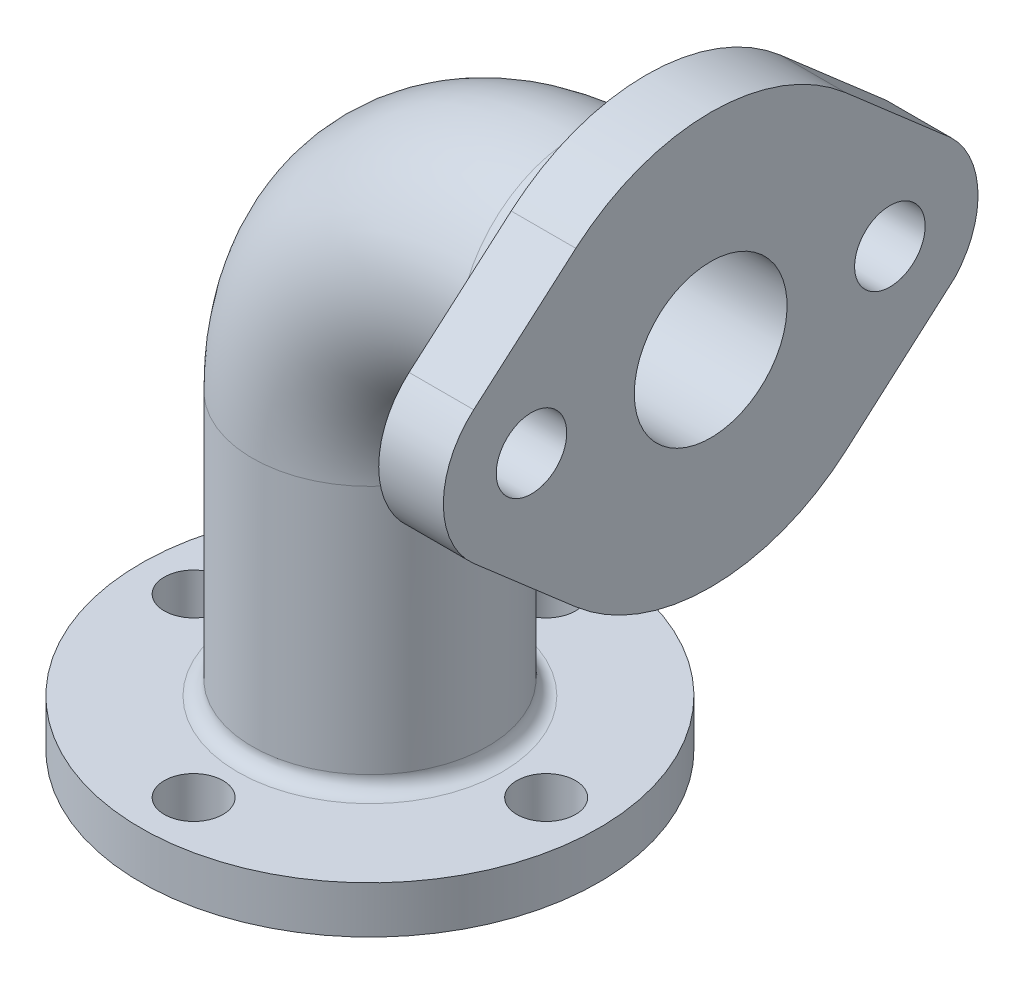
ISO-10303-21;
HEADER;
FILE_DESCRIPTION(('STEP AP214'),'2;1');
FILE_NAME('part.step','',(''),(''),'','','');
FILE_SCHEMA(('AUTOMOTIVE_DESIGN { 1 0 10303 214 1 1 1 1 }'));
ENDSEC;
DATA;
#1=APPLICATION_CONTEXT('core data for automotive mechanical design processes');
#2=APPLICATION_PROTOCOL_DEFINITION('international standard','automotive_design',2000,#1);
#3=PRODUCT_CONTEXT('',#1,'mechanical');
#4=PRODUCT('Part','Part','',(#3));
#5=PRODUCT_RELATED_PRODUCT_CATEGORY('part','',(#4));
#6=PRODUCT_DEFINITION_FORMATION('','',#4);
#7=PRODUCT_DEFINITION_CONTEXT('part definition',#1,'design');
#8=PRODUCT_DEFINITION('design','',#6,#7);
#9=PRODUCT_DEFINITION_SHAPE('','',#8);
#10=(LENGTH_UNIT() NAMED_UNIT(*) SI_UNIT(.MILLI.,.METRE.));
#11=(NAMED_UNIT(*) PLANE_ANGLE_UNIT() SI_UNIT($,.RADIAN.));
#12=(NAMED_UNIT(*) SI_UNIT($,.STERADIAN.) SOLID_ANGLE_UNIT());
#13=UNCERTAINTY_MEASURE_WITH_UNIT(LENGTH_MEASURE(1.E-05),#10,'distance_accuracy_value','');
#14=(GEOMETRIC_REPRESENTATION_CONTEXT(3) GLOBAL_UNCERTAINTY_ASSIGNED_CONTEXT((#13)) GLOBAL_UNIT_ASSIGNED_CONTEXT((#10,
#11,#12)) REPRESENTATION_CONTEXT('',''));
#15=CARTESIAN_POINT('',(0.,0.,0.));
#16=DIRECTION('',(0.,0.,1.));
#17=DIRECTION('',(1.,0.,0.));
#18=AXIS2_PLACEMENT_3D('',#15,#16,#17);
#19=CARTESIAN_POINT('',(0.,0.,0.));
#20=DIRECTION('',(0.,1.,0.));
#21=DIRECTION('',(0.,0.,1.));
#22=AXIS2_PLACEMENT_3D('',#19,#20,#21);
#23=CYLINDRICAL_SURFACE('',#22,20.);
#24=CARTESIAN_POINT('',(0.,10.5,0.));
#25=DIRECTION('',(0.,-1.,0.));
#26=DIRECTION('',(0.,0.,-1.));
#27=AXIS2_PLACEMENT_3D('',#24,#25,#26);
#28=CIRCLE('',#27,20.);
#29=CARTESIAN_POINT('',(0.,10.5,-20.));
#30=VERTEX_POINT('',#29);
#31=EDGE_CURVE('E12',#30,#30,#28,.F.);
#32=ORIENTED_EDGE('',*,*,#31,.T.);
#33=EDGE_LOOP('',(#32));
#34=FACE_BOUND('',#33,.T.);
#35=CARTESIAN_POINT('',(0.,53.,0.));
#36=DIRECTION('',(0.,-1.,0.));
#37=DIRECTION('',(0.,0.,1.));
#38=AXIS2_PLACEMENT_3D('',#35,#36,#37);
#39=CIRCLE('',#38,20.);
#40=CARTESIAN_POINT('',(-20.,53.,0.));
#41=VERTEX_POINT('',#40);
#42=EDGE_CURVE('E227',#41,#41,#39,.T.);
#43=ORIENTED_EDGE('',*,*,#42,.T.);
#44=EDGE_LOOP('',(#43));
#45=FACE_BOUND('',#44,.T.);
#46=ADVANCED_FACE('F57',(#34,#45),#23,.T.);
#47=CARTESIAN_POINT('',(35.,88.,0.));
#48=DIRECTION('',(1.,0.,0.));
#49=DIRECTION('',(0.,0.,-1.));
#50=AXIS2_PLACEMENT_3D('',#47,#48,#49);
#51=CYLINDRICAL_SURFACE('',#50,20.);
#52=CARTESIAN_POINT('',(44.5,88.,0.));
#53=DIRECTION('',(1.,0.,0.));
#54=DIRECTION('',(0.,0.,-1.));
#55=AXIS2_PLACEMENT_3D('',#52,#53,#54);
#56=CIRCLE('',#55,20.);
#57=CARTESIAN_POINT('',(44.5,88.,-20.));
#58=VERTEX_POINT('',#57);
#59=EDGE_CURVE('E257',#58,#58,#56,.F.);
#60=ORIENTED_EDGE('',*,*,#59,.T.);
#61=EDGE_LOOP('',(#60));
#62=FACE_BOUND('',#61,.T.);
#63=CARTESIAN_POINT('',(35.,88.,0.));
#64=DIRECTION('',(-1.,0.,0.));
#65=DIRECTION('',(0.,0.,1.));
#66=AXIS2_PLACEMENT_3D('',#63,#64,#65);
#67=CIRCLE('',#66,20.);
#68=CARTESIAN_POINT('',(35.,108.,0.));
#69=VERTEX_POINT('',#68);
#70=EDGE_CURVE('E231',#69,#69,#67,.T.);
#71=ORIENTED_EDGE('',*,*,#70,.F.);
#72=EDGE_LOOP('',(#71));
#73=FACE_BOUND('',#72,.T.);
#74=ADVANCED_FACE('F278',(#62,#73),#51,.T.);
#75=CARTESIAN_POINT('',(0.,0.,0.));
#76=DIRECTION('',(0.,-1.,0.));
#77=DIRECTION('',(0.,0.,1.));
#78=AXIS2_PLACEMENT_3D('',#75,#76,#77);
#79=PLANE('',#78);
#80=CARTESIAN_POINT('',(0.,0.,30.));
#81=DIRECTION('',(0.,-1.,0.));
#82=DIRECTION('',(0.,0.,-1.));
#83=AXIS2_PLACEMENT_3D('',#80,#81,#82);
#84=CIRCLE('',#83,5.);
#85=CARTESIAN_POINT('',(0.,0.,25.));
#86=VERTEX_POINT('',#85);
#87=EDGE_CURVE('E241',#86,#86,#84,.T.);
#88=ORIENTED_EDGE('',*,*,#87,.F.);
#89=EDGE_LOOP('',(#88));
#90=FACE_BOUND('',#89,.T.);
#91=CARTESIAN_POINT('',(0.,0.,-30.));
#92=DIRECTION('',(0.,-1.,0.));
#93=DIRECTION('',(0.,0.,-1.));
#94=AXIS2_PLACEMENT_3D('',#91,#92,#93);
#95=CIRCLE('',#94,5.);
#96=CARTESIAN_POINT('',(0.,0.,-35.));
#97=VERTEX_POINT('',#96);
#98=EDGE_CURVE('E452',#97,#97,#95,.T.);
#99=ORIENTED_EDGE('',*,*,#98,.F.);
#100=EDGE_LOOP('',(#99));
#101=FACE_BOUND('',#100,.T.);
#102=CARTESIAN_POINT('',(30.,0.,0.));
#103=DIRECTION('',(0.,-1.,0.));
#104=DIRECTION('',(0.,0.,-1.));
#105=AXIS2_PLACEMENT_3D('',#102,#103,#104);
#106=CIRCLE('',#105,5.);
#107=CARTESIAN_POINT('',(30.,0.,-5.));
#108=VERTEX_POINT('',#107);
#109=EDGE_CURVE('E448',#108,#108,#106,.T.);
#110=ORIENTED_EDGE('',*,*,#109,.F.);
#111=EDGE_LOOP('',(#110));
#112=FACE_BOUND('',#111,.T.);
#113=CARTESIAN_POINT('',(-30.,0.,0.));
#114=DIRECTION('',(0.,-1.,0.));
#115=DIRECTION('',(0.,0.,-1.));
#116=AXIS2_PLACEMENT_3D('',#113,#114,#115);
#117=CIRCLE('',#116,5.);
#118=CARTESIAN_POINT('',(-30.,0.,-5.));
#119=VERTEX_POINT('',#118);
#120=EDGE_CURVE('E407',#119,#119,#117,.T.);
#121=ORIENTED_EDGE('',*,*,#120,.F.);
#122=EDGE_LOOP('',(#121));
#123=FACE_BOUND('',#122,.T.);
#124=CARTESIAN_POINT('',(0.,0.,0.));
#125=DIRECTION('',(0.,-1.,0.));
#126=DIRECTION('',(0.,0.,-1.));
#127=AXIS2_PLACEMENT_3D('',#124,#125,#126);
#128=CIRCLE('',#127,13.);
#129=CARTESIAN_POINT('',(0.,0.,-13.));
#130=VERTEX_POINT('',#129);
#131=EDGE_CURVE('E196',#130,#130,#128,.T.);
#132=ORIENTED_EDGE('',*,*,#131,.F.);
#133=EDGE_LOOP('',(#132));
#134=FACE_BOUND('',#133,.T.);
#135=CARTESIAN_POINT('',(0.,0.,0.));
#136=DIRECTION('',(0.,-1.,0.));
#137=DIRECTION('',(0.,0.,-1.));
#138=AXIS2_PLACEMENT_3D('',#135,#136,#137);
#139=CIRCLE('',#138,39.);
#140=CARTESIAN_POINT('',(0.,0.,-39.));
#141=VERTEX_POINT('',#140);
#142=EDGE_CURVE('E253',#141,#141,#139,.T.);
#143=ORIENTED_EDGE('',*,*,#142,.T.);
#144=EDGE_LOOP('',(#143));
#145=FACE_BOUND('',#144,.T.);
#146=ADVANCED_FACE('F284',(#90,#101,#112,#123,#134,#145),#79,.T.);
#147=CARTESIAN_POINT('',(58.,88.,0.));
#148=DIRECTION('',(-1.,0.,0.));
#149=DIRECTION('',(0.,0.,1.));
#150=AXIS2_PLACEMENT_3D('',#147,#148,#149);
#151=PLANE('',#150);
#152=CARTESIAN_POINT('',(58.,88.,0.));
#153=DIRECTION('',(-1.,0.,0.));
#154=DIRECTION('',(0.,0.,1.));
#155=AXIS2_PLACEMENT_3D('',#152,#153,#154);
#156=CIRCLE('',#155,13.);
#157=CARTESIAN_POINT('',(58.,88.,13.));
#158=VERTEX_POINT('',#157);
#159=EDGE_CURVE('E220',#158,#158,#156,.T.);
#160=ORIENTED_EDGE('',*,*,#159,.T.);
#161=EDGE_LOOP('',(#160));
#162=FACE_BOUND('',#161,.T.);
#163=CARTESIAN_POINT('',(58.,88.,-30.5));
#164=DIRECTION('',(1.,0.,0.));
#165=DIRECTION('',(0.,0.,-1.));
#166=AXIS2_PLACEMENT_3D('',#163,#164,#165);
#167=CIRCLE('',#166,6.);
#168=CARTESIAN_POINT('',(58.,88.,-36.5));
#169=VERTEX_POINT('',#168);
#170=EDGE_CURVE('E397',#169,#169,#167,.T.);
#171=ORIENTED_EDGE('',*,*,#170,.F.);
#172=EDGE_LOOP('',(#171));
#173=FACE_BOUND('',#172,.T.);
#174=CARTESIAN_POINT('',(58.,88.,30.5));
#175=DIRECTION('',(1.,0.,0.));
#176=DIRECTION('',(0.,0.,-1.));
#177=AXIS2_PLACEMENT_3D('',#174,#175,#176);
#178=CIRCLE('',#177,6.00000000000001);
#179=CARTESIAN_POINT('',(58.,88.,24.5));
#180=VERTEX_POINT('',#179);
#181=EDGE_CURVE('E412',#180,#180,#178,.T.);
#182=ORIENTED_EDGE('',*,*,#181,.F.);
#183=EDGE_LOOP('',(#182));
#184=FACE_BOUND('',#183,.T.);
#185=CARTESIAN_POINT('',(58.,88.,30.5));
#186=DIRECTION('',(1.,0.,0.));
#187=DIRECTION('',(0.,0.,-1.));
#188=AXIS2_PLACEMENT_3D('',#185,#186,#187);
#189=CIRCLE('',#188,15.);
#190=CARTESIAN_POINT('',(58.,99.3248317439372,40.3360655737705));
#191=VERTEX_POINT('',#190);
#192=CARTESIAN_POINT('',(58.,76.6751682560628,40.3360655737705));
#193=VERTEX_POINT('',#192);
#194=EDGE_CURVE('E163',#191,#193,#189,.T.);
#195=ORIENTED_EDGE('',*,*,#194,.T.);
#196=DIRECTION('',(0.,-0.655737704918033,-0.754988782929145));
#197=VECTOR('',#196,1.);
#198=CARTESIAN_POINT('',(58.,76.6751682560628,40.3360655737705));
#199=LINE('',#198,#197);
#200=CARTESIAN_POINT('',(58.,61.5753925974799,22.9508196721312));
#201=VERTEX_POINT('',#200);
#202=EDGE_CURVE('E167',#193,#201,#199,.T.);
#203=ORIENTED_EDGE('',*,*,#202,.T.);
#204=CARTESIAN_POINT('',(58.,88.,0.));
#205=DIRECTION('',(1.,0.,0.));
#206=DIRECTION('',(0.,0.,-1.));
#207=AXIS2_PLACEMENT_3D('',#204,#205,#206);
#208=CIRCLE('',#207,35.);
#209=CARTESIAN_POINT('',(58.,61.6645545986941,-23.0530760532047));
#210=VERTEX_POINT('',#209);
#211=EDGE_CURVE('E172',#201,#210,#208,.T.);
#212=ORIENTED_EDGE('',*,*,#211,.T.);
#213=DIRECTION('',(0.,0.658659315805848,-0.752441297180167));
#214=VECTOR('',#213,1.);
#215=CARTESIAN_POINT('',(58.,77.855747200422,-41.5496214929858));
#216=LINE('',#215,#214);
#217=CARTESIAN_POINT('',(58.,77.855747200422,-41.5496214929858));
#218=VERTEX_POINT('',#217);
#219=EDGE_CURVE('E176',#210,#218,#216,.T.);
#220=ORIENTED_EDGE('',*,*,#219,.T.);
#221=CARTESIAN_POINT('',(58.,88.,-30.5));
#222=DIRECTION('',(1.,0.,0.));
#223=DIRECTION('',(0.,0.,-1.));
#224=AXIS2_PLACEMENT_3D('',#221,#222,#223);
#225=CIRCLE('',#224,15.);
#226=CARTESIAN_POINT('',(58.,98.8521609170196,-40.8552210710883));
#227=VERTEX_POINT('',#226);
#228=EDGE_CURVE('E180',#218,#227,#225,.T.);
#229=ORIENTED_EDGE('',*,*,#228,.T.);
#230=DIRECTION('',(0.,0.656260611388749,0.754534300041864));
#231=VECTOR('',#230,1.);
#232=CARTESIAN_POINT('',(58.,98.8521609170196,-40.8552210710883));
#233=LINE('',#232,#231);
#234=CARTESIAN_POINT('',(58.,114.408700501465,-22.9691213986062));
#235=VERTEX_POINT('',#234);
#236=EDGE_CURVE('E184',#227,#235,#233,.T.);
#237=ORIENTED_EDGE('',*,*,#236,.T.);
#238=CARTESIAN_POINT('',(58.,88.,0.));
#239=DIRECTION('',(1.,0.,0.));
#240=DIRECTION('',(0.,0.,-1.));
#241=AXIS2_PLACEMENT_3D('',#238,#239,#240);
#242=CIRCLE('',#241,35.);
#243=CARTESIAN_POINT('',(58.,114.42460740252,22.9508196721311));
#244=VERTEX_POINT('',#243);
#245=EDGE_CURVE('E135',#235,#244,#242,.T.);
#246=ORIENTED_EDGE('',*,*,#245,.T.);
#247=DIRECTION('',(0.,-0.655737704918033,0.754988782929145));
#248=VECTOR('',#247,1.);
#249=CARTESIAN_POINT('',(58.,99.3248317439372,40.3360655737705));
#250=LINE('',#249,#248);
#251=EDGE_CURVE('E189',#244,#191,#250,.T.);
#252=ORIENTED_EDGE('',*,*,#251,.T.);
#253=EDGE_LOOP('',(#195,#203,#212,#220,#229,#237,#246,#252));
#254=FACE_BOUND('',#253,.T.);
#255=ADVANCED_FACE('F295',(#162,#173,#184,#254),#151,.F.);
#256=CARTESIAN_POINT('',(35.,53.,0.));
#257=DIRECTION('',(0.,0.,-1.));
#258=DIRECTION('',(-1.,0.,0.));
#259=AXIS2_PLACEMENT_3D('',#256,#257,#258);
#260=TOROIDAL_SURFACE('',#259,35.,20.);
#261=CARTESIAN_POINT('',(35.,53.,0.));
#262=DIRECTION('',(0.,0.,-1.));
#263=DIRECTION('',(-1.,0.,0.));
#264=AXIS2_PLACEMENT_3D('',#261,#262,#263);
#265=CIRCLE('',#264,55.);
#266=EDGE_CURVE('',#41,#69,#265,.T.);
#267=ORIENTED_EDGE('',*,*,#42,.F.);
#268=ORIENTED_EDGE('',*,*,#70,.T.);
#269=ORIENTED_EDGE('',*,*,#266,.T.);
#270=ORIENTED_EDGE('',*,*,#266,.F.);
#271=EDGE_LOOP('',(#267,#269,#268,#270));
#272=FACE_BOUND('',#271,.T.);
#273=ADVANCED_FACE('F287',(#272),#260,.T.);
#274=CARTESIAN_POINT('',(0.,0.,0.));
#275=DIRECTION('',(0.,1.,0.));
#276=DIRECTION('',(0.,0.,1.));
#277=AXIS2_PLACEMENT_3D('',#274,#275,#276);
#278=CYLINDRICAL_SURFACE('',#277,13.);
#279=ORIENTED_EDGE('',*,*,#131,.T.);
#280=EDGE_LOOP('',(#279));
#281=FACE_BOUND('',#280,.T.);
#282=CARTESIAN_POINT('',(0.,53.,0.));
#283=DIRECTION('',(0.,1.,0.));
#284=DIRECTION('',(0.,0.,1.));
#285=AXIS2_PLACEMENT_3D('',#282,#283,#284);
#286=CIRCLE('',#285,13.);
#287=CARTESIAN_POINT('',(-13.,53.,0.));
#288=VERTEX_POINT('',#287);
#289=EDGE_CURVE('E212',#288,#288,#286,.F.);
#290=ORIENTED_EDGE('',*,*,#289,.F.);
#291=EDGE_LOOP('',(#290));
#292=FACE_BOUND('',#291,.T.);
#293=ADVANCED_FACE('F294',(#281,#292),#278,.F.);
#294=CARTESIAN_POINT('',(35.,53.,0.));
#295=DIRECTION('',(0.,0.,-1.));
#296=DIRECTION('',(-1.,0.,0.));
#297=AXIS2_PLACEMENT_3D('',#294,#295,#296);
#298=TOROIDAL_SURFACE('',#297,35.,13.);
#299=CARTESIAN_POINT('',(35.,88.,0.));
#300=DIRECTION('',(-1.,0.,0.));
#301=DIRECTION('',(0.,-1.,0.));
#302=AXIS2_PLACEMENT_3D('',#299,#300,#301);
#303=CIRCLE('',#302,13.);
#304=CARTESIAN_POINT('',(35.,101.,0.));
#305=VERTEX_POINT('',#304);
#306=EDGE_CURVE('E216',#305,#305,#303,.T.);
#307=CARTESIAN_POINT('',(35.,53.,0.));
#308=DIRECTION('',(0.,0.,-1.));
#309=DIRECTION('',(-1.,0.,0.));
#310=AXIS2_PLACEMENT_3D('',#307,#308,#309);
#311=CIRCLE('',#310,48.);
#312=EDGE_CURVE('',#288,#305,#311,.T.);
#313=ORIENTED_EDGE('',*,*,#289,.T.);
#314=ORIENTED_EDGE('',*,*,#306,.F.);
#315=ORIENTED_EDGE('',*,*,#312,.T.);
#316=ORIENTED_EDGE('',*,*,#312,.F.);
#317=EDGE_LOOP('',(#313,#315,#314,#316));
#318=FACE_BOUND('',#317,.T.);
#319=ADVANCED_FACE('F311',(#318),#298,.F.);
#320=CARTESIAN_POINT('',(35.,88.,0.));
#321=DIRECTION('',(1.,0.,0.));
#322=DIRECTION('',(0.,0.,-1.));
#323=AXIS2_PLACEMENT_3D('',#320,#321,#322);
#324=CYLINDRICAL_SURFACE('',#323,13.);
#325=ORIENTED_EDGE('',*,*,#159,.F.);
#326=EDGE_LOOP('',(#325));
#327=FACE_BOUND('',#326,.T.);
#328=ORIENTED_EDGE('',*,*,#306,.T.);
#329=EDGE_LOOP('',(#328));
#330=FACE_BOUND('',#329,.T.);
#331=ADVANCED_FACE('F291',(#327,#330),#324,.F.);
#332=CARTESIAN_POINT('',(47.,88.,30.5));
#333=DIRECTION('',(1.,0.,0.));
#334=DIRECTION('',(0.,0.,-1.));
#335=AXIS2_PLACEMENT_3D('',#332,#333,#334);
#336=CYLINDRICAL_SURFACE('',#335,15.);
#337=ORIENTED_EDGE('',*,*,#194,.F.);
#338=DIRECTION('',(1.,0.,0.));
#339=VECTOR('',#338,1.);
#340=CARTESIAN_POINT('',(47.,99.3248317439372,40.3360655737705));
#341=LINE('',#340,#339);
#342=CARTESIAN_POINT('',(47.,99.3248317439372,40.3360655737705));
#343=VERTEX_POINT('',#342);
#344=EDGE_CURVE('E75',#343,#191,#341,.T.);
#345=ORIENTED_EDGE('',*,*,#344,.F.);
#346=CARTESIAN_POINT('',(47.,88.,30.5));
#347=DIRECTION('',(1.,0.,0.));
#348=DIRECTION('',(0.,0.,-1.));
#349=AXIS2_PLACEMENT_3D('',#346,#347,#348);
#350=CIRCLE('',#349,15.);
#351=CARTESIAN_POINT('',(47.,76.6751682560628,40.3360655737705));
#352=VERTEX_POINT('',#351);
#353=EDGE_CURVE('E193',#343,#352,#350,.T.);
#354=ORIENTED_EDGE('',*,*,#353,.T.);
#355=DIRECTION('',(1.,0.,0.));
#356=VECTOR('',#355,1.);
#357=CARTESIAN_POINT('',(47.,76.6751682560628,40.3360655737705));
#358=LINE('',#357,#356);
#359=EDGE_CURVE('E116',#352,#193,#358,.T.);
#360=ORIENTED_EDGE('',*,*,#359,.T.);
#361=EDGE_LOOP('',(#337,#345,#354,#360));
#362=FACE_BOUND('',#361,.T.);
#363=ADVANCED_FACE('F310',(#362),#336,.T.);
#364=CARTESIAN_POINT('',(47.,99.3248317439372,40.3360655737705));
#365=DIRECTION('',(0.,0.754988782929145,0.655737704918033));
#366=DIRECTION('',(0.,-0.655737704918033,0.754988782929145));
#367=AXIS2_PLACEMENT_3D('',#364,#365,#366);
#368=PLANE('',#367);
#369=ORIENTED_EDGE('',*,*,#251,.F.);
#370=DIRECTION('',(1.,0.,0.));
#371=VECTOR('',#370,1.);
#372=CARTESIAN_POINT('',(47.,114.42460740252,22.9508196721311));
#373=LINE('',#372,#371);
#374=CARTESIAN_POINT('',(47.,114.42460740252,22.9508196721311));
#375=VERTEX_POINT('',#374);
#376=EDGE_CURVE('E104',#375,#244,#373,.T.);
#377=ORIENTED_EDGE('',*,*,#376,.F.);
#378=DIRECTION('',(0.,-0.655737704918033,0.754988782929145));
#379=VECTOR('',#378,1.);
#380=CARTESIAN_POINT('',(47.,99.3248317439372,40.3360655737705));
#381=LINE('',#380,#379);
#382=EDGE_CURVE('E149',#375,#343,#381,.T.);
#383=ORIENTED_EDGE('',*,*,#382,.T.);
#384=ORIENTED_EDGE('',*,*,#344,.T.);
#385=EDGE_LOOP('',(#369,#377,#383,#384));
#386=FACE_BOUND('',#385,.T.);
#387=ADVANCED_FACE('F317',(#386),#368,.T.);
#388=CARTESIAN_POINT('',(47.,88.,0.));
#389=DIRECTION('',(1.,0.,0.));
#390=DIRECTION('',(0.,0.,-1.));
#391=AXIS2_PLACEMENT_3D('',#388,#389,#390);
#392=CYLINDRICAL_SURFACE('',#391,35.);
#393=ORIENTED_EDGE('',*,*,#245,.F.);
#394=DIRECTION('',(1.,0.,0.));
#395=VECTOR('',#394,1.);
#396=CARTESIAN_POINT('',(47.,114.408700501465,-22.9691213986062));
#397=LINE('',#396,#395);
#398=CARTESIAN_POINT('',(47.,114.408700501465,-22.9691213986062));
#399=VERTEX_POINT('',#398);
#400=EDGE_CURVE('E130',#399,#235,#397,.T.);
#401=ORIENTED_EDGE('',*,*,#400,.F.);
#402=CARTESIAN_POINT('',(47.,88.,0.));
#403=DIRECTION('',(1.,0.,0.));
#404=DIRECTION('',(0.,0.,-1.));
#405=AXIS2_PLACEMENT_3D('',#402,#403,#404);
#406=CIRCLE('',#405,35.);
#407=EDGE_CURVE('E133',#399,#375,#406,.T.);
#408=ORIENTED_EDGE('',*,*,#407,.T.);
#409=ORIENTED_EDGE('',*,*,#376,.T.);
#410=EDGE_LOOP('',(#393,#401,#408,#409));
#411=FACE_BOUND('',#410,.T.);
#412=ADVANCED_FACE('F132',(#411),#392,.T.);
#413=CARTESIAN_POINT('',(47.,98.8521609170196,-40.8552210710883));
#414=DIRECTION('',(0.,0.754534300041864,-0.656260611388749));
#415=DIRECTION('',(0.,0.656260611388749,0.754534300041864));
#416=AXIS2_PLACEMENT_3D('',#413,#414,#415);
#417=PLANE('',#416);
#418=ORIENTED_EDGE('',*,*,#236,.F.);
#419=DIRECTION('',(1.,0.,0.));
#420=VECTOR('',#419,1.);
#421=CARTESIAN_POINT('',(47.,98.8521609170196,-40.8552210710883));
#422=LINE('',#421,#420);
#423=CARTESIAN_POINT('',(47.,98.8521609170196,-40.8552210710883));
#424=VERTEX_POINT('',#423);
#425=EDGE_CURVE('E141',#424,#227,#422,.T.);
#426=ORIENTED_EDGE('',*,*,#425,.F.);
#427=DIRECTION('',(0.,0.656260611388749,0.754534300041864));
#428=VECTOR('',#427,1.);
#429=CARTESIAN_POINT('',(47.,98.8521609170196,-40.8552210710883));
#430=LINE('',#429,#428);
#431=EDGE_CURVE('E147',#424,#399,#430,.T.);
#432=ORIENTED_EDGE('',*,*,#431,.T.);
#433=ORIENTED_EDGE('',*,*,#400,.T.);
#434=EDGE_LOOP('',(#418,#426,#432,#433));
#435=FACE_BOUND('',#434,.T.);
#436=ADVANCED_FACE('F152',(#435),#417,.T.);
#437=CARTESIAN_POINT('',(47.,88.,-30.5));
#438=DIRECTION('',(1.,0.,0.));
#439=DIRECTION('',(0.,0.,-1.));
#440=AXIS2_PLACEMENT_3D('',#437,#438,#439);
#441=CYLINDRICAL_SURFACE('',#440,15.);
#442=ORIENTED_EDGE('',*,*,#228,.F.);
#443=DIRECTION('',(1.,0.,0.));
#444=VECTOR('',#443,1.);
#445=CARTESIAN_POINT('',(47.,77.855747200422,-41.5496214929858));
#446=LINE('',#445,#444);
#447=CARTESIAN_POINT('',(47.,77.855747200422,-41.5496214929858));
#448=VERTEX_POINT('',#447);
#449=EDGE_CURVE('E201',#448,#218,#446,.T.);
#450=ORIENTED_EDGE('',*,*,#449,.F.);
#451=CARTESIAN_POINT('',(47.,88.,-30.5));
#452=DIRECTION('',(1.,0.,0.));
#453=DIRECTION('',(0.,0.,-1.));
#454=AXIS2_PLACEMENT_3D('',#451,#452,#453);
#455=CIRCLE('',#454,15.);
#456=EDGE_CURVE('E154',#448,#424,#455,.T.);
#457=ORIENTED_EDGE('',*,*,#456,.T.);
#458=ORIENTED_EDGE('',*,*,#425,.T.);
#459=EDGE_LOOP('',(#442,#450,#457,#458));
#460=FACE_BOUND('',#459,.T.);
#461=ADVANCED_FACE('F343',(#460),#441,.T.);
#462=CARTESIAN_POINT('',(47.,77.855747200422,-41.5496214929858));
#463=DIRECTION('',(0.,-0.752441297180167,-0.658659315805848));
#464=DIRECTION('',(0.,0.658659315805848,-0.752441297180167));
#465=AXIS2_PLACEMENT_3D('',#462,#463,#464);
#466=PLANE('',#465);
#467=ORIENTED_EDGE('',*,*,#219,.F.);
#468=DIRECTION('',(1.,0.,0.));
#469=VECTOR('',#468,1.);
#470=CARTESIAN_POINT('',(47.,61.6645545986941,-23.0530760532047));
#471=LINE('',#470,#469);
#472=CARTESIAN_POINT('',(47.,61.6645545986941,-23.0530760532047));
#473=VERTEX_POINT('',#472);
#474=EDGE_CURVE('E204',#473,#210,#471,.T.);
#475=ORIENTED_EDGE('',*,*,#474,.F.);
#476=DIRECTION('',(0.,0.658659315805848,-0.752441297180167));
#477=VECTOR('',#476,1.);
#478=CARTESIAN_POINT('',(47.,77.855747200422,-41.5496214929858));
#479=LINE('',#478,#477);
#480=EDGE_CURVE('E157',#473,#448,#479,.T.);
#481=ORIENTED_EDGE('',*,*,#480,.T.);
#482=ORIENTED_EDGE('',*,*,#449,.T.);
#483=EDGE_LOOP('',(#467,#475,#481,#482));
#484=FACE_BOUND('',#483,.T.);
#485=ADVANCED_FACE('F339',(#484),#466,.T.);
#486=CARTESIAN_POINT('',(47.,88.,0.));
#487=DIRECTION('',(1.,0.,0.));
#488=DIRECTION('',(0.,0.,-1.));
#489=AXIS2_PLACEMENT_3D('',#486,#487,#488);
#490=CYLINDRICAL_SURFACE('',#489,35.);
#491=ORIENTED_EDGE('',*,*,#211,.F.);
#492=DIRECTION('',(1.,0.,0.));
#493=VECTOR('',#492,1.);
#494=CARTESIAN_POINT('',(47.,61.5753925974799,22.9508196721312));
#495=LINE('',#494,#493);
#496=CARTESIAN_POINT('',(47.,61.5753925974799,22.9508196721312));
#497=VERTEX_POINT('',#496);
#498=EDGE_CURVE('E207',#497,#201,#495,.T.);
#499=ORIENTED_EDGE('',*,*,#498,.F.);
#500=CARTESIAN_POINT('',(47.,88.,0.));
#501=DIRECTION('',(1.,0.,0.));
#502=DIRECTION('',(0.,0.,-1.));
#503=AXIS2_PLACEMENT_3D('',#500,#501,#502);
#504=CIRCLE('',#503,35.);
#505=EDGE_CURVE('E425',#497,#473,#504,.T.);
#506=ORIENTED_EDGE('',*,*,#505,.T.);
#507=ORIENTED_EDGE('',*,*,#474,.T.);
#508=EDGE_LOOP('',(#491,#499,#506,#507));
#509=FACE_BOUND('',#508,.T.);
#510=ADVANCED_FACE('F336',(#509),#490,.T.);
#511=CARTESIAN_POINT('',(47.,76.6751682560628,40.3360655737705));
#512=DIRECTION('',(0.,-0.754988782929145,0.655737704918033));
#513=DIRECTION('',(0.,-0.655737704918033,-0.754988782929145));
#514=AXIS2_PLACEMENT_3D('',#511,#512,#513);
#515=PLANE('',#514);
#516=ORIENTED_EDGE('',*,*,#202,.F.);
#517=ORIENTED_EDGE('',*,*,#359,.F.);
#518=DIRECTION('',(0.,-0.655737704918033,-0.754988782929145));
#519=VECTOR('',#518,1.);
#520=CARTESIAN_POINT('',(47.,76.6751682560628,40.3360655737705));
#521=LINE('',#520,#519);
#522=EDGE_CURVE('E422',#352,#497,#521,.T.);
#523=ORIENTED_EDGE('',*,*,#522,.T.);
#524=ORIENTED_EDGE('',*,*,#498,.T.);
#525=EDGE_LOOP('',(#516,#517,#523,#524));
#526=FACE_BOUND('',#525,.T.);
#527=ADVANCED_FACE('F333',(#526),#515,.T.);
#528=CARTESIAN_POINT('',(47.,88.,30.5));
#529=DIRECTION('',(1.,0.,0.));
#530=DIRECTION('',(0.,0.,-1.));
#531=AXIS2_PLACEMENT_3D('',#528,#529,#530);
#532=PLANE('',#531);
#533=CARTESIAN_POINT('',(47.,88.,0.));
#534=DIRECTION('',(1.,0.,0.));
#535=DIRECTION('',(0.,0.,-1.));
#536=AXIS2_PLACEMENT_3D('',#533,#534,#535);
#537=CIRCLE('',#536,22.5);
#538=CARTESIAN_POINT('',(47.,88.,-22.5));
#539=VERTEX_POINT('',#538);
#540=EDGE_CURVE('E235',#539,#539,#537,.T.);
#541=ORIENTED_EDGE('',*,*,#540,.T.);
#542=EDGE_LOOP('',(#541));
#543=FACE_BOUND('',#542,.T.);
#544=CARTESIAN_POINT('',(47.,88.,-30.5));
#545=DIRECTION('',(1.,0.,0.));
#546=DIRECTION('',(0.,0.,-1.));
#547=AXIS2_PLACEMENT_3D('',#544,#545,#546);
#548=CIRCLE('',#547,6.);
#549=CARTESIAN_POINT('',(47.,88.,-36.5));
#550=VERTEX_POINT('',#549);
#551=EDGE_CURVE('E402',#550,#550,#548,.T.);
#552=ORIENTED_EDGE('',*,*,#551,.T.);
#553=EDGE_LOOP('',(#552));
#554=FACE_BOUND('',#553,.T.);
#555=CARTESIAN_POINT('',(47.,88.,30.5));
#556=DIRECTION('',(1.,0.,0.));
#557=DIRECTION('',(0.,0.,-1.));
#558=AXIS2_PLACEMENT_3D('',#555,#556,#557);
#559=CIRCLE('',#558,6.00000000000001);
#560=CARTESIAN_POINT('',(47.,88.,24.5));
#561=VERTEX_POINT('',#560);
#562=EDGE_CURVE('E168',#561,#561,#559,.T.);
#563=ORIENTED_EDGE('',*,*,#562,.T.);
#564=EDGE_LOOP('',(#563));
#565=FACE_BOUND('',#564,.T.);
#566=ORIENTED_EDGE('',*,*,#353,.F.);
#567=ORIENTED_EDGE('',*,*,#382,.F.);
#568=ORIENTED_EDGE('',*,*,#407,.F.);
#569=ORIENTED_EDGE('',*,*,#431,.F.);
#570=ORIENTED_EDGE('',*,*,#456,.F.);
#571=ORIENTED_EDGE('',*,*,#480,.F.);
#572=ORIENTED_EDGE('',*,*,#505,.F.);
#573=ORIENTED_EDGE('',*,*,#522,.F.);
#574=EDGE_LOOP('',(#566,#567,#568,#569,#570,#571,#572,#573));
#575=FACE_BOUND('',#574,.T.);
#576=ADVANCED_FACE('F145',(#543,#554,#565,#575),#532,.F.);
#577=CARTESIAN_POINT('',(47.,88.,30.5));
#578=DIRECTION('',(1.,0.,0.));
#579=DIRECTION('',(0.,0.,-1.));
#580=AXIS2_PLACEMENT_3D('',#577,#578,#579);
#581=CYLINDRICAL_SURFACE('',#580,6.00000000000001);
#582=ORIENTED_EDGE('',*,*,#562,.F.);
#583=EDGE_LOOP('',(#582));
#584=FACE_BOUND('',#583,.T.);
#585=ORIENTED_EDGE('',*,*,#181,.T.);
#586=EDGE_LOOP('',(#585));
#587=FACE_BOUND('',#586,.T.);
#588=ADVANCED_FACE('F356',(#584,#587),#581,.F.);
#589=CARTESIAN_POINT('',(47.,88.,-30.5));
#590=DIRECTION('',(1.,0.,0.));
#591=DIRECTION('',(0.,0.,-1.));
#592=AXIS2_PLACEMENT_3D('',#589,#590,#591);
#593=CYLINDRICAL_SURFACE('',#592,6.);
#594=ORIENTED_EDGE('',*,*,#551,.F.);
#595=EDGE_LOOP('',(#594));
#596=FACE_BOUND('',#595,.T.);
#597=ORIENTED_EDGE('',*,*,#170,.T.);
#598=EDGE_LOOP('',(#597));
#599=FACE_BOUND('',#598,.T.);
#600=ADVANCED_FACE('F360',(#596,#599),#593,.F.);
#601=CARTESIAN_POINT('',(0.,8.,0.));
#602=DIRECTION('',(0.,-1.,0.));
#603=DIRECTION('',(0.,0.,-1.));
#604=AXIS2_PLACEMENT_3D('',#601,#602,#603);
#605=PLANE('',#604);
#606=CARTESIAN_POINT('',(0.,8.,0.));
#607=DIRECTION('',(0.,-1.,0.));
#608=DIRECTION('',(0.,0.,-1.));
#609=AXIS2_PLACEMENT_3D('',#606,#607,#608);
#610=CIRCLE('',#609,22.5);
#611=CARTESIAN_POINT('',(0.,8.,-22.5));
#612=VERTEX_POINT('',#611);
#613=EDGE_CURVE('E67',#612,#612,#610,.T.);
#614=ORIENTED_EDGE('',*,*,#613,.T.);
#615=EDGE_LOOP('',(#614));
#616=FACE_BOUND('',#615,.T.);
#617=CARTESIAN_POINT('',(0.,8.,30.));
#618=DIRECTION('',(0.,-1.,0.));
#619=DIRECTION('',(0.,0.,-1.));
#620=AXIS2_PLACEMENT_3D('',#617,#618,#619);
#621=CIRCLE('',#620,5.);
#622=CARTESIAN_POINT('',(0.,8.,25.));
#623=VERTEX_POINT('',#622);
#624=EDGE_CURVE('E249',#623,#623,#621,.T.);
#625=ORIENTED_EDGE('',*,*,#624,.T.);
#626=EDGE_LOOP('',(#625));
#627=FACE_BOUND('',#626,.T.);
#628=CARTESIAN_POINT('',(0.,8.,-30.));
#629=DIRECTION('',(0.,-1.,0.));
#630=DIRECTION('',(0.,0.,-1.));
#631=AXIS2_PLACEMENT_3D('',#628,#629,#630);
#632=CIRCLE('',#631,5.);
#633=CARTESIAN_POINT('',(0.,8.,-35.));
#634=VERTEX_POINT('',#633);
#635=EDGE_CURVE('E245',#634,#634,#632,.T.);
#636=ORIENTED_EDGE('',*,*,#635,.T.);
#637=EDGE_LOOP('',(#636));
#638=FACE_BOUND('',#637,.T.);
#639=CARTESIAN_POINT('',(30.,8.,0.));
#640=DIRECTION('',(0.,-1.,0.));
#641=DIRECTION('',(0.,0.,-1.));
#642=AXIS2_PLACEMENT_3D('',#639,#640,#641);
#643=CIRCLE('',#642,5.);
#644=CARTESIAN_POINT('',(30.,8.,-5.));
#645=VERTEX_POINT('',#644);
#646=EDGE_CURVE('E240',#645,#645,#643,.T.);
#647=ORIENTED_EDGE('',*,*,#646,.T.);
#648=EDGE_LOOP('',(#647));
#649=FACE_BOUND('',#648,.T.);
#650=CARTESIAN_POINT('',(-30.,8.,0.));
#651=DIRECTION('',(0.,-1.,0.));
#652=DIRECTION('',(0.,0.,-1.));
#653=AXIS2_PLACEMENT_3D('',#650,#651,#652);
#654=CIRCLE('',#653,5.);
#655=CARTESIAN_POINT('',(-30.,8.,-5.));
#656=VERTEX_POINT('',#655);
#657=EDGE_CURVE('E236',#656,#656,#654,.T.);
#658=ORIENTED_EDGE('',*,*,#657,.T.);
#659=EDGE_LOOP('',(#658));
#660=FACE_BOUND('',#659,.T.);
#661=CARTESIAN_POINT('',(0.,8.,0.));
#662=DIRECTION('',(0.,-1.,0.));
#663=DIRECTION('',(0.,0.,-1.));
#664=AXIS2_PLACEMENT_3D('',#661,#662,#663);
#665=CIRCLE('',#664,39.);
#666=CARTESIAN_POINT('',(0.,8.,-39.));
#667=VERTEX_POINT('',#666);
#668=EDGE_CURVE('E395',#667,#667,#665,.T.);
#669=ORIENTED_EDGE('',*,*,#668,.F.);
#670=EDGE_LOOP('',(#669));
#671=FACE_BOUND('',#670,.T.);
#672=ADVANCED_FACE('F264',(#616,#627,#638,#649,#660,#671),#605,.F.);
#673=CARTESIAN_POINT('',(0.,8.,0.));
#674=DIRECTION('',(0.,-1.,0.));
#675=DIRECTION('',(0.,0.,-1.));
#676=AXIS2_PLACEMENT_3D('',#673,#674,#675);
#677=CYLINDRICAL_SURFACE('',#676,39.);
#678=ORIENTED_EDGE('',*,*,#668,.T.);
#679=EDGE_LOOP('',(#678));
#680=FACE_BOUND('',#679,.T.);
#681=ORIENTED_EDGE('',*,*,#142,.F.);
#682=EDGE_LOOP('',(#681));
#683=FACE_BOUND('',#682,.T.);
#684=ADVANCED_FACE('F364',(#680,#683),#677,.T.);
#685=CARTESIAN_POINT('',(-30.,15.,0.));
#686=DIRECTION('',(0.,-1.,0.));
#687=DIRECTION('',(0.,0.,-1.));
#688=AXIS2_PLACEMENT_3D('',#685,#686,#687);
#689=CYLINDRICAL_SURFACE('',#688,5.);
#690=ORIENTED_EDGE('',*,*,#120,.T.);
#691=EDGE_LOOP('',(#690));
#692=FACE_BOUND('',#691,.T.);
#693=ORIENTED_EDGE('',*,*,#657,.F.);
#694=EDGE_LOOP('',(#693));
#695=FACE_BOUND('',#694,.T.);
#696=ADVANCED_FACE('F366',(#692,#695),#689,.F.);
#697=CARTESIAN_POINT('',(30.,15.,0.));
#698=DIRECTION('',(0.,-1.,0.));
#699=DIRECTION('',(0.,0.,-1.));
#700=AXIS2_PLACEMENT_3D('',#697,#698,#699);
#701=CYLINDRICAL_SURFACE('',#700,5.);
#702=ORIENTED_EDGE('',*,*,#109,.T.);
#703=EDGE_LOOP('',(#702));
#704=FACE_BOUND('',#703,.T.);
#705=ORIENTED_EDGE('',*,*,#646,.F.);
#706=EDGE_LOOP('',(#705));
#707=FACE_BOUND('',#706,.T.);
#708=ADVANCED_FACE('F370',(#704,#707),#701,.F.);
#709=CARTESIAN_POINT('',(0.,15.,-30.));
#710=DIRECTION('',(0.,-1.,0.));
#711=DIRECTION('',(0.,0.,-1.));
#712=AXIS2_PLACEMENT_3D('',#709,#710,#711);
#713=CYLINDRICAL_SURFACE('',#712,5.);
#714=ORIENTED_EDGE('',*,*,#98,.T.);
#715=EDGE_LOOP('',(#714));
#716=FACE_BOUND('',#715,.T.);
#717=ORIENTED_EDGE('',*,*,#635,.F.);
#718=EDGE_LOOP('',(#717));
#719=FACE_BOUND('',#718,.T.);
#720=ADVANCED_FACE('F374',(#716,#719),#713,.F.);
#721=CARTESIAN_POINT('',(0.,15.,30.));
#722=DIRECTION('',(0.,-1.,0.));
#723=DIRECTION('',(0.,0.,-1.));
#724=AXIS2_PLACEMENT_3D('',#721,#722,#723);
#725=CYLINDRICAL_SURFACE('',#724,5.);
#726=ORIENTED_EDGE('',*,*,#87,.T.);
#727=EDGE_LOOP('',(#726));
#728=FACE_BOUND('',#727,.T.);
#729=ORIENTED_EDGE('',*,*,#624,.F.);
#730=EDGE_LOOP('',(#729));
#731=FACE_BOUND('',#730,.T.);
#732=ADVANCED_FACE('F274',(#728,#731),#725,.F.);
#733=CARTESIAN_POINT('',(44.5,88.,0.));
#734=DIRECTION('',(1.,0.,0.));
#735=DIRECTION('',(0.,0.,-1.));
#736=AXIS2_PLACEMENT_3D('',#733,#734,#735);
#737=TOROIDAL_SURFACE('',#736,22.5,2.5);
#738=ORIENTED_EDGE('',*,*,#59,.F.);
#739=EDGE_LOOP('',(#738));
#740=FACE_BOUND('',#739,.T.);
#741=ORIENTED_EDGE('',*,*,#540,.F.);
#742=EDGE_LOOP('',(#741));
#743=FACE_BOUND('',#742,.T.);
#744=ADVANCED_FACE('F268',(#740,#743),#737,.F.);
#745=CARTESIAN_POINT('',(0.,10.5,0.));
#746=DIRECTION('',(0.,-1.,0.));
#747=DIRECTION('',(0.,0.,-1.));
#748=AXIS2_PLACEMENT_3D('',#745,#746,#747);
#749=TOROIDAL_SURFACE('',#748,22.5,2.5);
#750=ORIENTED_EDGE('',*,*,#31,.F.);
#751=EDGE_LOOP('',(#750));
#752=FACE_BOUND('',#751,.T.);
#753=ORIENTED_EDGE('',*,*,#613,.F.);
#754=EDGE_LOOP('',(#753));
#755=FACE_BOUND('',#754,.T.);
#756=ADVANCED_FACE('F59',(#752,#755),#749,.F.);
#757=CLOSED_SHELL('',(#46,#74,#146,#255,#273,#293,#319,#331,#363,#387,#412,#436,#461,#485,#510,
#527,#576,#588,#600,#672,#684,#696,#708,#720,#732,#744,#756));
#758=MANIFOLD_SOLID_BREP('B2',#757);
#759=ADVANCED_BREP_SHAPE_REPRESENTATION('',(#18,#758),#14);
#760=SHAPE_DEFINITION_REPRESENTATION(#9,#759);
ENDSEC;
END-ISO-10303-21;
